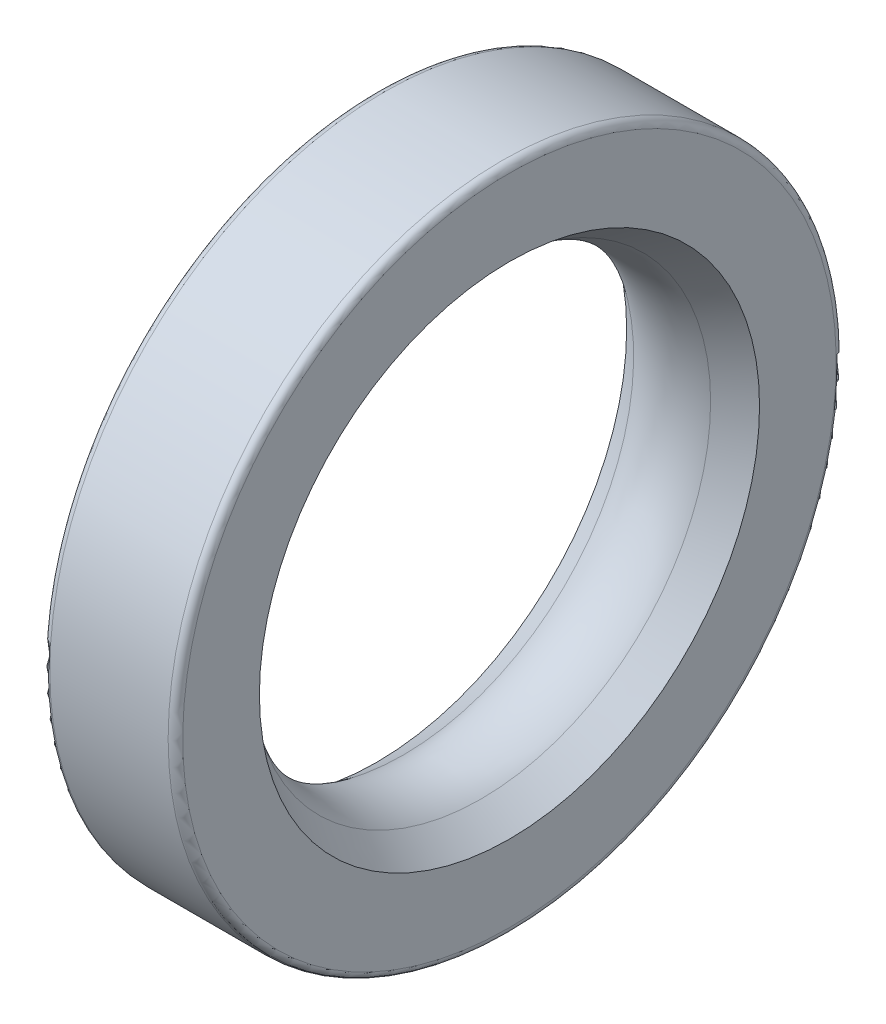
ISO-10303-21;
HEADER;
FILE_DESCRIPTION(('STEP AP214'),'2;1');
FILE_NAME('part.step','',(''),(''),'','','');
FILE_SCHEMA(('AUTOMOTIVE_DESIGN { 1 0 10303 214 1 1 1 1 }'));
ENDSEC;
DATA;
#1=APPLICATION_CONTEXT('core data for automotive mechanical design processes');
#2=APPLICATION_PROTOCOL_DEFINITION('international standard','automotive_design',2000,#1);
#3=PRODUCT_CONTEXT('',#1,'mechanical');
#4=PRODUCT('Part','Part','',(#3));
#5=PRODUCT_RELATED_PRODUCT_CATEGORY('part','',(#4));
#6=PRODUCT_DEFINITION_FORMATION('','',#4);
#7=PRODUCT_DEFINITION_CONTEXT('part definition',#1,'design');
#8=PRODUCT_DEFINITION('design','',#6,#7);
#9=PRODUCT_DEFINITION_SHAPE('','',#8);
#10=(LENGTH_UNIT() NAMED_UNIT(*) SI_UNIT(.MILLI.,.METRE.));
#11=(NAMED_UNIT(*) PLANE_ANGLE_UNIT() SI_UNIT($,.RADIAN.));
#12=(NAMED_UNIT(*) SI_UNIT($,.STERADIAN.) SOLID_ANGLE_UNIT());
#13=UNCERTAINTY_MEASURE_WITH_UNIT(LENGTH_MEASURE(1.E-05),#10,'distance_accuracy_value','');
#14=(GEOMETRIC_REPRESENTATION_CONTEXT(3) GLOBAL_UNCERTAINTY_ASSIGNED_CONTEXT((#13)) GLOBAL_UNIT_ASSIGNED_CONTEXT((#10,
#11,#12)) REPRESENTATION_CONTEXT('',''));
#15=CARTESIAN_POINT('',(0.,0.,0.));
#16=DIRECTION('',(0.,0.,1.));
#17=DIRECTION('',(1.,0.,0.));
#18=AXIS2_PLACEMENT_3D('',#15,#16,#17);
#19=CARTESIAN_POINT('',(-4.3499999999995,0.,0.));
#20=DIRECTION('',(-1.,0.,0.));
#21=DIRECTION('',(0.,0.,1.));
#22=AXIS2_PLACEMENT_3D('',#19,#20,#21);
#23=PLANE('',#22);
#24=CARTESIAN_POINT('',(-4.34999999998809,0.,0.));
#25=DIRECTION('',(1.,0.,0.));
#26=DIRECTION('',(0.,0.,-1.));
#27=AXIS2_PLACEMENT_3D('',#24,#25,#26);
#28=CIRCLE('',#27,3.42499999999291);
#29=CARTESIAN_POINT('',(-4.34999999998809,0.,-3.42499999999291));
#30=VERTEX_POINT('',#29);
#31=EDGE_CURVE('E18',#30,#30,#28,.F.);
#32=ORIENTED_EDGE('',*,*,#31,.T.);
#33=EDGE_LOOP('',(#32));
#34=FACE_BOUND('',#33,.T.);
#35=CARTESIAN_POINT('',(-4.3499999999995,0.,0.));
#36=DIRECTION('',(-1.,0.,0.));
#37=DIRECTION('',(0.,-1.,0.));
#38=AXIS2_PLACEMENT_3D('',#35,#36,#37);
#39=CIRCLE('',#38,4.475);
#40=CARTESIAN_POINT('',(-4.3499999999995,-4.475,0.));
#41=VERTEX_POINT('',#40);
#42=EDGE_CURVE('E53',#41,#41,#39,.T.);
#43=ORIENTED_EDGE('',*,*,#42,.F.);
#44=EDGE_LOOP('',(#43));
#45=FACE_BOUND('',#44,.T.);
#46=ADVANCED_FACE('F14',(#34,#45),#23,.F.);
#47=CARTESIAN_POINT('',(-4.4499999999995,0.,0.));
#48=DIRECTION('',(-1.,0.,0.));
#49=DIRECTION('',(0.,-1.,0.));
#50=AXIS2_PLACEMENT_3D('',#47,#48,#49);
#51=TOROIDAL_SURFACE('',#50,4.475,0.1);
#52=ORIENTED_EDGE('',*,*,#42,.T.);
#53=EDGE_LOOP('',(#52));
#54=FACE_BOUND('',#53,.T.);
#55=CARTESIAN_POINT('',(-4.4499999999995,0.,0.));
#56=DIRECTION('',(1.,0.,0.));
#57=DIRECTION('',(0.,0.,-1.));
#58=AXIS2_PLACEMENT_3D('',#55,#56,#57);
#59=CIRCLE('',#58,4.575);
#60=CARTESIAN_POINT('',(-4.4499999999995,0.,-4.575));
#61=VERTEX_POINT('',#60);
#62=EDGE_CURVE('E49',#61,#61,#59,.F.);
#63=ORIENTED_EDGE('',*,*,#62,.F.);
#64=EDGE_LOOP('',(#63));
#65=FACE_BOUND('',#64,.T.);
#66=ADVANCED_FACE('F33',(#54,#65),#51,.T.);
#67=CARTESIAN_POINT('',(-4.34999999998809,0.,0.));
#68=DIRECTION('',(1.,0.,0.));
#69=DIRECTION('',(0.,0.,-1.));
#70=AXIS2_PLACEMENT_3D('',#67,#68,#69);
#71=CONICAL_SURFACE('',#70,3.42499999999291,0.623947799108723);
#72=CARTESIAN_POINT('',(-4.73953470442882,0.,0.));
#73=DIRECTION('',(-1.,0.,0.));
#74=DIRECTION('',(0.,-1.,0.));
#75=AXIS2_PLACEMENT_3D('',#72,#73,#74);
#76=CIRCLE('',#75,3.14457952072617);
#77=CARTESIAN_POINT('',(-4.73953470442882,-3.14457952072617,0.));
#78=VERTEX_POINT('',#77);
#79=EDGE_CURVE('E65',#78,#78,#76,.F.);
#80=ORIENTED_EDGE('',*,*,#79,.F.);
#81=EDGE_LOOP('',(#80));
#82=FACE_BOUND('',#81,.T.);
#83=ORIENTED_EDGE('',*,*,#31,.F.);
#84=EDGE_LOOP('',(#83));
#85=FACE_BOUND('',#84,.T.);
#86=ADVANCED_FACE('F43',(#82,#85),#71,.F.);
#87=CARTESIAN_POINT('',(-4.259,0.,0.));
#88=DIRECTION('',(1.,0.,0.));
#89=DIRECTION('',(0.,0.,-1.));
#90=AXIS2_PLACEMENT_3D('',#87,#88,#89);
#91=CYLINDRICAL_SURFACE('',#90,4.575);
#92=CARTESIAN_POINT('',(-6.0699999999995,0.,0.));
#93=DIRECTION('',(-1.,0.,0.));
#94=DIRECTION('',(0.,-1.,0.));
#95=AXIS2_PLACEMENT_3D('',#92,#93,#94);
#96=CIRCLE('',#95,4.575);
#97=CARTESIAN_POINT('',(-6.0699999999995,-4.575,0.));
#98=VERTEX_POINT('',#97);
#99=EDGE_CURVE('E69',#98,#98,#96,.T.);
#100=ORIENTED_EDGE('',*,*,#99,.F.);
#101=EDGE_LOOP('',(#100));
#102=FACE_BOUND('',#101,.T.);
#103=ORIENTED_EDGE('',*,*,#62,.T.);
#104=EDGE_LOOP('',(#103));
#105=FACE_BOUND('',#104,.T.);
#106=ADVANCED_FACE('F83',(#102,#105),#91,.T.);
#107=CARTESIAN_POINT('',(-5.265353992262,0.,0.));
#108=DIRECTION('',(-1.,0.,0.));
#109=DIRECTION('',(0.,-1.,0.));
#110=AXIS2_PLACEMENT_3D('',#107,#108,#109);
#111=TOROIDAL_SURFACE('',#110,3.875,0.9);
#112=ORIENTED_EDGE('',*,*,#79,.T.);
#113=EDGE_LOOP('',(#112));
#114=FACE_BOUND('',#113,.T.);
#115=CARTESIAN_POINT('',(-5.80094700671907,0.,0.));
#116=DIRECTION('',(-1.,0.,0.));
#117=DIRECTION('',(0.,-1.,0.));
#118=AXIS2_PLACEMENT_3D('',#115,#116,#117);
#119=CIRCLE('',#118,3.15171573862472);
#120=CARTESIAN_POINT('',(-5.80094700671907,-3.15171573862472,0.));
#121=VERTEX_POINT('',#120);
#122=EDGE_CURVE('E26',#121,#121,#119,.T.);
#123=ORIENTED_EDGE('',*,*,#122,.T.);
#124=EDGE_LOOP('',(#123));
#125=FACE_BOUND('',#124,.T.);
#126=ADVANCED_FACE('F79',(#114,#125),#111,.T.);
#127=CARTESIAN_POINT('',(-6.0699999999995,0.,0.));
#128=DIRECTION('',(-1.,0.,0.));
#129=DIRECTION('',(0.,-1.,0.));
#130=AXIS2_PLACEMENT_3D('',#127,#128,#129);
#131=TOROIDAL_SURFACE('',#130,4.475,0.1);
#132=ORIENTED_EDGE('',*,*,#99,.T.);
#133=EDGE_LOOP('',(#132));
#134=FACE_BOUND('',#133,.T.);
#135=CARTESIAN_POINT('',(-6.1699999999995,0.,0.));
#136=DIRECTION('',(1.,0.,0.));
#137=DIRECTION('',(0.,-1.,0.));
#138=AXIS2_PLACEMENT_3D('',#135,#136,#137);
#139=CIRCLE('',#138,4.475);
#140=CARTESIAN_POINT('',(-6.1699999999995,-4.475,0.));
#141=VERTEX_POINT('',#140);
#142=EDGE_CURVE('E22',#141,#141,#139,.F.);
#143=ORIENTED_EDGE('',*,*,#142,.F.);
#144=EDGE_LOOP('',(#143));
#145=FACE_BOUND('',#144,.T.);
#146=ADVANCED_FACE('F82',(#134,#145),#131,.T.);
#147=CARTESIAN_POINT('',(-6.16999999976997,0.,0.));
#148=DIRECTION('',(-1.,0.,0.));
#149=DIRECTION('',(0.,0.,1.));
#150=AXIS2_PLACEMENT_3D('',#147,#148,#149);
#151=CONICAL_SURFACE('',#150,3.42499999987922,0.637394242856886);
#152=ORIENTED_EDGE('',*,*,#122,.F.);
#153=EDGE_LOOP('',(#152));
#154=FACE_BOUND('',#153,.T.);
#155=CARTESIAN_POINT('',(-6.1699999999405,0.,0.));
#156=DIRECTION('',(-1.,0.,0.));
#157=DIRECTION('',(0.,0.,1.));
#158=AXIS2_PLACEMENT_3D('',#155,#156,#157);
#159=CIRCLE('',#158,3.4250000000055);
#160=CARTESIAN_POINT('',(-6.1699999999405,0.,3.4250000000055));
#161=VERTEX_POINT('',#160);
#162=EDGE_CURVE('E10',#161,#161,#159,.F.);
#163=ORIENTED_EDGE('',*,*,#162,.F.);
#164=EDGE_LOOP('',(#163));
#165=FACE_BOUND('',#164,.T.);
#166=ADVANCED_FACE('F97',(#154,#165),#151,.F.);
#167=CARTESIAN_POINT('',(-6.1699999999995,0.,0.));
#168=DIRECTION('',(-1.,0.,0.));
#169=DIRECTION('',(0.,0.,1.));
#170=AXIS2_PLACEMENT_3D('',#167,#168,#169);
#171=PLANE('',#170);
#172=ORIENTED_EDGE('',*,*,#162,.T.);
#173=EDGE_LOOP('',(#172));
#174=FACE_BOUND('',#173,.T.);
#175=ORIENTED_EDGE('',*,*,#142,.T.);
#176=EDGE_LOOP('',(#175));
#177=FACE_BOUND('',#176,.T.);
#178=ADVANCED_FACE('F95',(#174,#177),#171,.T.);
#179=CLOSED_SHELL('',(#46,#66,#86,#106,#126,#146,#166,#178));
#180=MANIFOLD_SOLID_BREP('B1',#179);
#181=ADVANCED_BREP_SHAPE_REPRESENTATION('',(#18,#180),#14);
#182=SHAPE_DEFINITION_REPRESENTATION(#9,#181);
ENDSEC;
END-ISO-10303-21;
